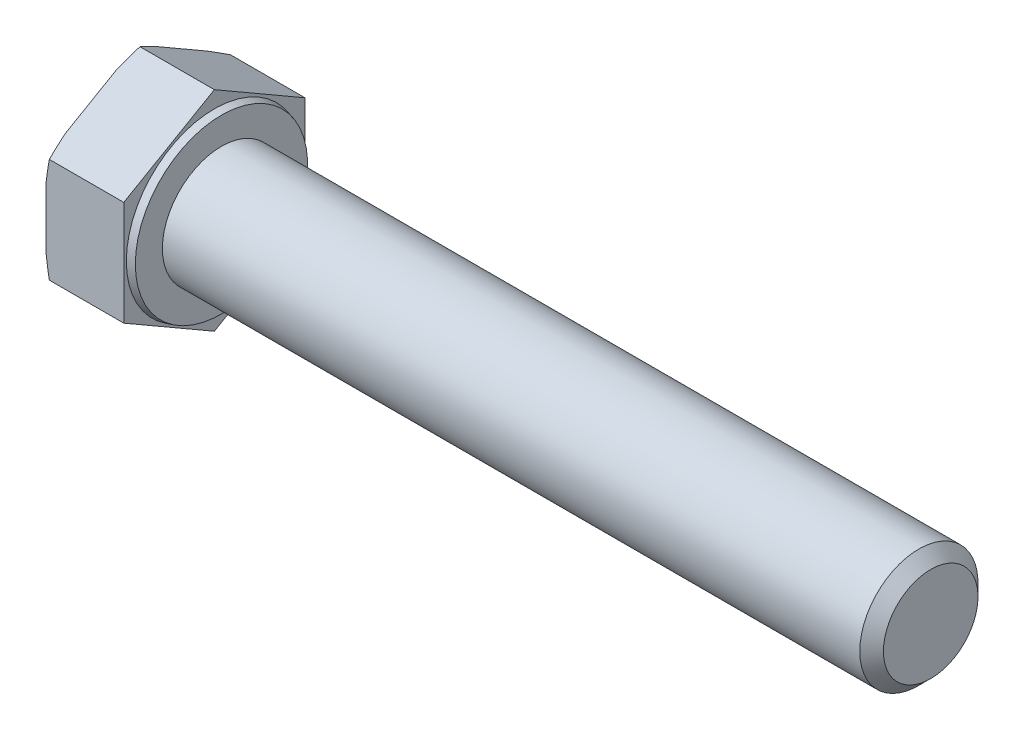
ISO-10303-21;
HEADER;
FILE_DESCRIPTION(('STEP AP214'),'2;1');
FILE_NAME('part.step','',(''),(''),'','','');
FILE_SCHEMA(('AUTOMOTIVE_DESIGN { 1 0 10303 214 1 1 1 1 }'));
ENDSEC;
DATA;
#1=APPLICATION_CONTEXT('core data for automotive mechanical design processes');
#2=APPLICATION_PROTOCOL_DEFINITION('international standard','automotive_design',2000,#1);
#3=PRODUCT_CONTEXT('',#1,'mechanical');
#4=PRODUCT('Part','Part','',(#3));
#5=PRODUCT_RELATED_PRODUCT_CATEGORY('part','',(#4));
#6=PRODUCT_DEFINITION_FORMATION('','',#4);
#7=PRODUCT_DEFINITION_CONTEXT('part definition',#1,'design');
#8=PRODUCT_DEFINITION('design','',#6,#7);
#9=PRODUCT_DEFINITION_SHAPE('','',#8);
#10=(LENGTH_UNIT() NAMED_UNIT(*) SI_UNIT(.MILLI.,.METRE.));
#11=(NAMED_UNIT(*) PLANE_ANGLE_UNIT() SI_UNIT($,.RADIAN.));
#12=(NAMED_UNIT(*) SI_UNIT($,.STERADIAN.) SOLID_ANGLE_UNIT());
#13=UNCERTAINTY_MEASURE_WITH_UNIT(LENGTH_MEASURE(1.E-05),#10,'distance_accuracy_value','');
#14=(GEOMETRIC_REPRESENTATION_CONTEXT(3) GLOBAL_UNCERTAINTY_ASSIGNED_CONTEXT((#13)) GLOBAL_UNIT_ASSIGNED_CONTEXT((#10,
#11,#12)) REPRESENTATION_CONTEXT('',''));
#15=CARTESIAN_POINT('',(0.,0.,0.));
#16=DIRECTION('',(0.,0.,1.));
#17=DIRECTION('',(1.,0.,0.));
#18=AXIS2_PLACEMENT_3D('',#15,#16,#17);
#19=CARTESIAN_POINT('',(60.6,-4.42500000000009,-7.66432482349223));
#20=DIRECTION('',(0.,-0.866025403784441,-0.499999999999995));
#21=DIRECTION('',(0.,0.499999999999995,-0.866025403784442));
#22=AXIS2_PLACEMENT_3D('',#19,#20,#21);
#23=PLANE('',#22);
#24=DIRECTION('',(-1.,0.,0.));
#25=VECTOR('',#24,1.);
#26=CARTESIAN_POINT('',(60.6,-8.85,0.));
#27=LINE('',#26,#25);
#28=CARTESIAN_POINT('',(0.,-8.85,0.));
#29=VERTEX_POINT('',#28);
#30=CARTESIAN_POINT('',(-6.29792306844368,-8.85,0.));
#31=VERTEX_POINT('',#30);
#32=EDGE_CURVE('E158',#29,#31,#27,.T.);
#33=ORIENTED_EDGE('',*,*,#32,.T.);
#34=CARTESIAN_POINT('',(-4.7699615006699,-11.9174022332107,5.3128965151713));
#35=CARTESIAN_POINT('',(-4.83614833570257,-11.8050473190038,5.11829209528478));
#36=CARTESIAN_POINT('',(-4.90167255003095,-11.6925948603644,4.92351872348535));
#37=CARTESIAN_POINT('',(-5.03118559698242,-11.4674663528304,4.53358471020429));
#38=CARTESIAN_POINT('',(-5.09517439305191,-11.3547902986816,4.33842405962226));
#39=CARTESIAN_POINT('',(-5.28456041407138,-11.0163157536771,3.75216895060564));
#40=CARTESIAN_POINT('',(-5.40733223857273,-10.7901468045144,3.3604328395613));
#41=CARTESIAN_POINT('',(-5.6448059473252,-10.3342684187143,2.57082831328319));
#42=CARTESIAN_POINT('',(-5.75941225873481,-10.1045464495324,2.17293819104533));
#43=CARTESIAN_POINT('',(-5.97591685440881,-9.6436033227612,1.3745612760779));
#44=CARTESIAN_POINT('',(-6.07781581130404,-9.41238224520545,0.974074621970506));
#45=CARTESIAN_POINT('',(-6.26134144326315,-8.95638364479249,0.184261877874952));
#46=CARTESIAN_POINT('',(-6.34355573274743,-8.73166601658845,-0.204960471530827));
#47=CARTESIAN_POINT('',(-6.48746045966097,-8.2805512783751,-0.986314118159489));
#48=CARTESIAN_POINT('',(-6.54915189984519,-8.05415425097467,-1.37844527229961));
#49=CARTESIAN_POINT('',(-6.62254434564547,-7.71410474496151,-1.96742829380309));
#50=CARTESIAN_POINT('',(-6.64378861584913,-7.60095958105454,-2.16340146632068));
#51=CARTESIAN_POINT('',(-6.67950592063896,-7.37440457175732,-2.55580625313272));
#52=CARTESIAN_POINT('',(-6.69397933196105,-7.26099474144627,-2.75223784130921));
#53=CARTESIAN_POINT('',(-6.71577657593379,-7.03401139991638,-3.14538452131075));
#54=CARTESIAN_POINT('',(-6.72310096885371,-6.92043790222292,-3.34209958970914));
#55=CARTESIAN_POINT('',(-6.73040192529392,-6.69323186195545,-3.73563199523893));
#56=CARTESIAN_POINT('',(-6.73037853713207,-6.57959931977464,-3.93244933168932));
#57=CARTESIAN_POINT('',(-6.72320871548941,-6.35929562962563,-4.31402651612232));
#58=CARTESIAN_POINT('',(-6.71649505277964,-6.25262090601261,-4.49879255730344));
#59=CARTESIAN_POINT('',(-6.69675463432834,-6.03941600442701,-4.86807427927242));
#60=CARTESIAN_POINT('',(-6.68372760236287,-5.93288583298344,-5.05258994875172));
#61=CARTESIAN_POINT('',(-6.63559663675346,-5.61363013252953,-5.60555704254388));
#62=CARTESIAN_POINT('',(-6.59144268713134,-5.40123548697151,-5.97343535990596));
#63=CARTESIAN_POINT('',(-6.48226269320506,-4.97681311893133,-6.70855646522027));
#64=CARTESIAN_POINT('',(-6.41713860156276,-4.7647919199632,-7.07578795411473));
#65=CARTESIAN_POINT('',(-6.27018625376656,-4.34222339340586,-7.80769811179158));
#66=CARTESIAN_POINT('',(-6.18835790112246,-4.1316760743376,-8.17237676581522));
#67=CARTESIAN_POINT('',(-6.00866271800198,-3.70472589760515,-8.91187616421634));
#68=CARTESIAN_POINT('',(-5.91033992742069,-3.48837165185492,-9.286612710289));
#69=CARTESIAN_POINT('',(-5.70311989656312,-3.05693413716248,-10.0338844060276));
#70=CARTESIAN_POINT('',(-5.59422212603359,-2.84185093252738,-10.4064194443103));
#71=CARTESIAN_POINT('',(-5.36943684134144,-2.41473283183158,-11.1462096955477));
#72=CARTESIAN_POINT('',(-5.25362330968472,-2.2026881429877,-11.5134818701005));
#73=CARTESIAN_POINT('',(-5.07537550670142,-1.88529185166037,-12.0632283728134));
#74=CARTESIAN_POINT('',(-5.01521325258259,-1.77961882394802,-12.2462594258008));
#75=CARTESIAN_POINT('',(-4.89354912869936,-1.56846779942573,-12.6119837283436));
#76=CARTESIAN_POINT('',(-4.83204728425027,-1.462989798971,-12.794676984212));
#77=CARTESIAN_POINT('',(-4.7699615006699,-1.35759776678936,-12.9772213386635));
#78=B_SPLINE_CURVE_WITH_KNOTS('',3,(#34,#35,#36,#37,#38,#39,#40,#41,#42,#43,#44,#45,#46,#47,#48,
#49,#50,#51,#52,#53,#54,#55,#56,#57,#58,#59,#60,#61,#62,#63,#64,#65,#66,#67,#68,#69,#70,#71,#72,
#73,#74,#75,#76,#77),.UNSPECIFIED.,.F.,.F.,(4,2,2,2,2,2,2,2,2,2,2,2,2,2,2,2,2,2,2,2,2,4),(0.,
0.70276173034238,1.40554017472233,2.81157217612387,4.23201032618944,5.6523732571052,
7.02270828812481,8.39297635416766,9.07474696516833,9.75647963740091,10.438158877887,
11.119833635759,11.7601005309412,12.4003954417532,13.6809617128842,14.9676044823533,
16.2542546841745,17.5852978857349,18.9164078632869,20.2352036230902,20.894426976119,
21.553637882061),.UNSPECIFIED.);
#79=CARTESIAN_POINT('',(-6.58000000000003,-7.90869530364146,-1.63038755949604));
#80=VERTEX_POINT('',#79);
#81=EDGE_CURVE('E203',#31,#80,#78,.T.);
#82=ORIENTED_EDGE('',*,*,#81,.T.);
#83=DIRECTION('',(0.,-0.499999999999995,0.866025403784442));
#84=VECTOR('',#83,1.);
#85=CARTESIAN_POINT('',(-6.58,-4.42500000000009,-7.66432482349223));
#86=LINE('',#85,#84);
#87=CARTESIAN_POINT('',(-6.58,-5.36630469635854,-6.03393726399618));
#88=VERTEX_POINT('',#87);
#89=EDGE_CURVE('E213',#88,#80,#86,.T.);
#90=ORIENTED_EDGE('',*,*,#89,.F.);
#91=CARTESIAN_POINT('',(-6.29792306844368,-4.42500000000009,-7.66432482349223));
#92=VERTEX_POINT('',#91);
#93=EDGE_CURVE('E216',#88,#92,#78,.T.);
#94=ORIENTED_EDGE('',*,*,#93,.T.);
#95=DIRECTION('',(-1.,0.,0.));
#96=VECTOR('',#95,1.);
#97=CARTESIAN_POINT('',(60.6,-4.42500000000009,-7.66432482349223));
#98=LINE('',#97,#96);
#99=CARTESIAN_POINT('',(0.,-4.42500000000009,-7.66432482349223));
#100=VERTEX_POINT('',#99);
#101=EDGE_CURVE('E169',#100,#92,#98,.T.);
#102=ORIENTED_EDGE('',*,*,#101,.F.);
#103=DIRECTION('',(0.,-0.499999999999995,0.866025403784442));
#104=VECTOR('',#103,1.);
#105=CARTESIAN_POINT('',(0.,-4.42500000000009,-7.66432482349223));
#106=LINE('',#105,#104);
#107=EDGE_CURVE('E184',#100,#29,#106,.T.);
#108=ORIENTED_EDGE('',*,*,#107,.T.);
#109=EDGE_LOOP('',(#33,#82,#90,#94,#102,#108));
#110=FACE_BOUND('',#109,.T.);
#111=ADVANCED_FACE('F36',(#110),#23,.T.);
#112=CARTESIAN_POINT('',(60.6,4.42499999999993,-7.66432482349232));
#113=DIRECTION('',(0.,0.,-1.));
#114=DIRECTION('',(0.,1.,0.));
#115=AXIS2_PLACEMENT_3D('',#112,#113,#114);
#116=PLANE('',#115);
#117=ORIENTED_EDGE('',*,*,#101,.T.);
#118=CARTESIAN_POINT('',(-5.00864005639831,-9.73789651517145,-7.66432482349217));
#119=CARTESIAN_POINT('',(-5.07003318744064,-9.52322769233334,-7.66432482349218));
#120=CARTESIAN_POINT('',(-5.13071664914256,-9.30835600664128,-7.66432482349218));
#121=CARTESIAN_POINT('',(-5.2504442425723,-8.87815277711283,-7.66432482349218));
#122=CARTESIAN_POINT('',(-5.30948834652955,-8.66282122555281,-7.66432482349219));
#123=CARTESIAN_POINT('',(-5.48387527888684,-8.01589307910885,-7.66432482349219));
#124=CARTESIAN_POINT('',(-5.59642298983084,-7.58353558067021,-7.6643248234922));
#125=CARTESIAN_POINT('',(-5.81266226723173,-6.71259000391773,-7.66432482349221));
#126=CARTESIAN_POINT('',(-5.91626806915323,-6.27398046842187,-7.66432482349221));
#127=CARTESIAN_POINT('',(-6.11029091280608,-5.39384656433909,-7.66432482349222));
#128=CARTESIAN_POINT('',(-6.20070892550878,-4.95232241284974,-7.66432482349222));
#129=CARTESIAN_POINT('',(-6.36160933963008,-4.08051166755351,-7.66432482349223));
#130=CARTESIAN_POINT('',(-6.43264625776086,-3.65032885049375,-7.66432482349224));
#131=CARTESIAN_POINT('',(-6.55428187483288,-2.78707107422335,-7.66432482349225));
#132=CARTESIAN_POINT('',(-6.60488453148917,-2.35399669158535,-7.66432482349225));
#133=CARTESIAN_POINT('',(-6.66240831794471,-1.70368188145931,-7.66432482349226));
#134=CARTESIAN_POINT('',(-6.67850532779577,-1.48723464984804,-7.66432482349226));
#135=CARTESIAN_POINT('',(-6.70429433272965,-1.05396299728827,-7.66432482349227));
#136=CARTESIAN_POINT('',(-6.71398664875919,-0.837138595786226,-7.66432482349227));
#137=CARTESIAN_POINT('',(-6.72672253024382,-0.403302294793051,-7.66432482349227));
#138=CARTESIAN_POINT('',(-6.72976638437883,-0.186290403852155,-7.66432482349227));
#139=CARTESIAN_POINT('',(-6.7291358967764,0.247718950123678,-7.66432482349228));
#140=CARTESIAN_POINT('',(-6.72546155695146,0.464716413162706,-7.66432482349228));
#141=CARTESIAN_POINT('',(-6.70624362970486,1.06036953223341,-7.66432482349229));
#142=CARTESIAN_POINT('',(-6.68388895075078,1.43882252598365,-7.66432482349229));
#143=CARTESIAN_POINT('',(-6.62050559151052,2.19412494594648,-7.6643248234923));
#144=CARTESIAN_POINT('',(-6.57947609181733,2.57097430106276,-7.6643248234923));
#145=CARTESIAN_POINT('',(-6.48113797206862,3.32388976987407,-7.66432482349231));
#146=CARTESIAN_POINT('',(-6.4237712185853,3.69994816672772,-7.66432482349232));
#147=CARTESIAN_POINT('',(-6.2956564145037,4.44978573942378,-7.66432482349232));
#148=CARTESIAN_POINT('',(-6.22490691200718,4.82356466341955,-7.66432482349233));
#149=CARTESIAN_POINT('',(-6.0704014797458,5.58003633732887,-7.66432482349234));
#150=CARTESIAN_POINT('',(-5.98632024183774,5.96266195818458,-7.66432482349234));
#151=CARTESIAN_POINT('',(-5.80919867667365,6.72583533235177,-7.66432482349235));
#152=CARTESIAN_POINT('',(-5.71615790531566,7.10638298167437,-7.66432482349235));
#153=CARTESIAN_POINT('',(-5.52374117974904,7.86297645537245,-7.66432482349236));
#154=CARTESIAN_POINT('',(-5.42441511026811,8.23903503370974,-7.66432482349236));
#155=CARTESIAN_POINT('',(-5.27134102225385,8.80195695976291,-7.66432482349237));
#156=CARTESIAN_POINT('',(-5.21964171692946,8.98938164843282,-7.66432482349237));
#157=CARTESIAN_POINT('',(-5.11502150400523,9.36388780999383,-7.66432482349237));
#158=CARTESIAN_POINT('',(-5.06210060924165,9.55096928646908,-7.66432482349238));
#159=CARTESIAN_POINT('',(-5.00864005639831,9.73789651517129,-7.66432482349238));
#160=B_SPLINE_CURVE_WITH_KNOTS('',3,(#118,#119,#120,#121,#122,#123,#124,#125,#126,#127,#128,
#129,#130,#131,#132,#133,#134,#135,#136,#137,#138,#139,#140,#141,#142,#143,#144,#145,#146,#147,
#148,#149,#150,#151,#152,#153,#154,#155,#156,#157,#158,#159),.UNSPECIFIED.,.F.,.F.,(4,2,2,2,2,2,
2,2,2,2,2,2,2,2,2,2,2,2,2,2,4),(0.,0.669823290546161,1.33965792092904,2.67986595636369,
4.03175825312792,5.38355096443301,6.69120700403605,7.99860965473741,8.64966414612008,
9.300686009923,9.95167960543101,10.6026730156168,11.7394565125237,12.876289893615,
14.0172201663474,15.1582742899967,16.3334026116279,17.5085892114817,18.6753990362947,
19.2586689197893,19.8419326771629),.UNSPECIFIED.);
#161=CARTESIAN_POINT('',(-6.58000000000003,-2.54239060728318,-7.66432482349217));
#162=VERTEX_POINT('',#161);
#163=EDGE_CURVE('E224',#92,#162,#160,.T.);
#164=ORIENTED_EDGE('',*,*,#163,.T.);
#165=DIRECTION('',(0.,-1.,0.));
#166=VECTOR('',#165,1.);
#167=CARTESIAN_POINT('',(-6.58,4.42499999999993,-7.66432482349232));
#168=LINE('',#167,#166);
#169=CARTESIAN_POINT('',(-6.58,2.54239060728305,-7.6643248234923));
#170=VERTEX_POINT('',#169);
#171=EDGE_CURVE('E164',#170,#162,#168,.T.);
#172=ORIENTED_EDGE('',*,*,#171,.F.);
#173=CARTESIAN_POINT('',(-6.29792306844368,4.42499999999993,-7.66432482349232));
#174=VERTEX_POINT('',#173);
#175=EDGE_CURVE('E51',#170,#174,#160,.T.);
#176=ORIENTED_EDGE('',*,*,#175,.T.);
#177=DIRECTION('',(-1.,0.,0.));
#178=VECTOR('',#177,1.);
#179=CARTESIAN_POINT('',(60.6,4.42499999999993,-7.66432482349232));
#180=LINE('',#179,#178);
#181=CARTESIAN_POINT('',(0.,4.42499999999993,-7.66432482349232));
#182=VERTEX_POINT('',#181);
#183=EDGE_CURVE('E155',#182,#174,#180,.T.);
#184=ORIENTED_EDGE('',*,*,#183,.F.);
#185=DIRECTION('',(0.,-1.,0.));
#186=VECTOR('',#185,1.);
#187=CARTESIAN_POINT('',(0.,8.84999999999992,-7.66432482349237));
#188=LINE('',#187,#186);
#189=EDGE_CURVE('E182',#182,#100,#188,.T.);
#190=ORIENTED_EDGE('',*,*,#189,.T.);
#191=EDGE_LOOP('',(#117,#164,#172,#176,#184,#190));
#192=FACE_BOUND('',#191,.T.);
#193=ADVANCED_FACE('F251',(#192),#116,.T.);
#194=CARTESIAN_POINT('',(60.6,8.85,0.));
#195=DIRECTION('',(0.,0.866025403784434,-0.500000000000007));
#196=DIRECTION('',(0.,0.500000000000007,0.866025403784435));
#197=AXIS2_PLACEMENT_3D('',#194,#195,#196);
#198=PLANE('',#197);
#199=ORIENTED_EDGE('',*,*,#183,.T.);
#200=CARTESIAN_POINT('',(-4.76996150066986,1.35759776678906,-12.9772213386637));
#201=CARTESIAN_POINT('',(-4.83614833570253,1.46995268099604,-12.7826169187772));
#202=CARTESIAN_POINT('',(-4.9016725500309,1.58240513963541,-12.5878435469777));
#203=CARTESIAN_POINT('',(-5.03118559698238,1.80753364716942,-12.1979095336967));
#204=CARTESIAN_POINT('',(-5.09517439305187,1.92020970131819,-12.0027488831146));
#205=CARTESIAN_POINT('',(-5.28456041407135,2.25868424632273,-11.416493774098));
#206=CARTESIAN_POINT('',(-5.40733223857269,2.48485319548548,-11.0247576630537));
#207=CARTESIAN_POINT('',(-5.64480594732518,2.94073158128551,-10.2351531367756));
#208=CARTESIAN_POINT('',(-5.75941225873478,3.17045355046743,-9.83726301453771));
#209=CARTESIAN_POINT('',(-5.97591685440879,3.63139667723867,-9.03888609957028));
#210=CARTESIAN_POINT('',(-6.07781581130402,3.86261775479443,-8.63839944546289));
#211=CARTESIAN_POINT('',(-6.26134144326313,4.3186163552074,-7.84858670136733));
#212=CARTESIAN_POINT('',(-6.34355573274742,4.54333398341145,-7.45936435196155));
#213=CARTESIAN_POINT('',(-6.48746045966097,4.99444872162482,-6.67801070533289));
#214=CARTESIAN_POINT('',(-6.54915189984519,5.22084574902526,-6.28587955119277));
#215=CARTESIAN_POINT('',(-6.62254434564547,5.56089525503842,-5.69689652968929));
#216=CARTESIAN_POINT('',(-6.64378861584913,5.6740404189454,-5.5009233571717));
#217=CARTESIAN_POINT('',(-6.67950592063896,5.90059542824263,-5.10851857035966));
#218=CARTESIAN_POINT('',(-6.69397933196106,6.01400525855368,-4.91208698218317));
#219=CARTESIAN_POINT('',(-6.7157765759338,6.24098860008357,-4.51894030218163));
#220=CARTESIAN_POINT('',(-6.72310096885372,6.35456209777704,-4.32222523378324));
#221=CARTESIAN_POINT('',(-6.73040192529394,6.58176813804451,-3.92869282825345));
#222=CARTESIAN_POINT('',(-6.73037853713208,6.69540068022533,-3.73187549180306));
#223=CARTESIAN_POINT('',(-6.72320871548943,6.91570437037435,-3.35029830737006));
#224=CARTESIAN_POINT('',(-6.71649505277966,7.02237909398737,-3.16553226618894));
#225=CARTESIAN_POINT('',(-6.69675463432836,7.23558399557298,-2.79625054421994));
#226=CARTESIAN_POINT('',(-6.68372760236289,7.34211416701656,-2.61173487474064));
#227=CARTESIAN_POINT('',(-6.63559663675348,7.66136986747048,-2.05876778094847));
#228=CARTESIAN_POINT('',(-6.59144268713136,7.87376451302852,-1.69088946358639));
#229=CARTESIAN_POINT('',(-6.48226269320508,8.29818688106872,-0.955768358272067));
#230=CARTESIAN_POINT('',(-6.41713860156277,8.51020808003686,-0.588536869377594));
#231=CARTESIAN_POINT('',(-6.27018625376657,8.93277660659422,0.143373288299262));
#232=CARTESIAN_POINT('',(-6.18835790112246,9.14332392566248,0.508051942322907));
#233=CARTESIAN_POINT('',(-6.00866271800198,9.57027410239495,1.24755134072404));
#234=CARTESIAN_POINT('',(-5.91033992742068,9.7866283481452,1.62228788679671));
#235=CARTESIAN_POINT('',(-5.7031198965631,10.2180658628377,2.36955958253528));
#236=CARTESIAN_POINT('',(-5.59422212603357,10.4331490674728,2.74209462081801));
#237=CARTESIAN_POINT('',(-5.36943684134141,10.8602671681686,3.48188487205548));
#238=CARTESIAN_POINT('',(-5.25362330968469,11.0723118570125,3.84915704660823));
#239=CARTESIAN_POINT('',(-5.07537550670138,11.3897081483398,4.39890354932111));
#240=CARTESIAN_POINT('',(-5.01521325258256,11.4953811760522,4.58193460230855));
#241=CARTESIAN_POINT('',(-4.89354912869931,11.7065322005745,4.94765890485139));
#242=CARTESIAN_POINT('',(-4.83204728425022,11.8120102010292,5.13035216071975));
#243=CARTESIAN_POINT('',(-4.76996150066986,11.9174022332109,5.3128965151713));
#244=B_SPLINE_CURVE_WITH_KNOTS('',3,(#200,#201,#202,#203,#204,#205,#206,#207,#208,#209,#210,
#211,#212,#213,#214,#215,#216,#217,#218,#219,#220,#221,#222,#223,#224,#225,#226,#227,#228,#229,
#230,#231,#232,#233,#234,#235,#236,#237,#238,#239,#240,#241,#242,#243),.UNSPECIFIED.,.F.,.F.,(4,
2,2,2,2,2,2,2,2,2,2,2,2,2,2,2,2,2,2,2,2,4),(0.,0.702761730342387,1.40554017472235,
2.8115721761239,4.23201032618948,5.65237325710526,7.02270828812488,8.39297635416775,
9.07474696516843,9.75647963740101,10.4381588778871,11.1198336357591,11.7601005309413,
12.4003954417533,13.6809617128843,14.9676044823535,16.2542546841748,17.5852978857351,
18.9164078632872,20.2352036230905,20.8944269761194,21.5536378820614),.UNSPECIFIED.);
#245=CARTESIAN_POINT('',(-6.58000000000003,5.36630469635833,-6.03393726399625));
#246=VERTEX_POINT('',#245);
#247=EDGE_CURVE('E246',#174,#246,#244,.T.);
#248=ORIENTED_EDGE('',*,*,#247,.T.);
#249=DIRECTION('',(0.,-0.500000000000007,-0.866025403784435));
#250=VECTOR('',#249,1.);
#251=CARTESIAN_POINT('',(-6.58,8.85,0.));
#252=LINE('',#251,#250);
#253=CARTESIAN_POINT('',(-6.58,7.90869530364155,-1.63038755949607));
#254=VERTEX_POINT('',#253);
#255=EDGE_CURVE('E236',#254,#246,#252,.T.);
#256=ORIENTED_EDGE('',*,*,#255,.F.);
#257=CARTESIAN_POINT('',(-6.29792306844368,8.85,0.));
#258=VERTEX_POINT('',#257);
#259=EDGE_CURVE('E59',#254,#258,#244,.T.);
#260=ORIENTED_EDGE('',*,*,#259,.T.);
#261=DIRECTION('',(-1.,0.,0.));
#262=VECTOR('',#261,1.);
#263=CARTESIAN_POINT('',(60.6,8.85,0.));
#264=LINE('',#263,#262);
#265=CARTESIAN_POINT('',(0.,8.85,0.));
#266=VERTEX_POINT('',#265);
#267=EDGE_CURVE('E152',#266,#258,#264,.T.);
#268=ORIENTED_EDGE('',*,*,#267,.F.);
#269=DIRECTION('',(0.,-0.500000000000007,-0.866025403784435));
#270=VECTOR('',#269,1.);
#271=CARTESIAN_POINT('',(0.,8.85000000000003,0.));
#272=LINE('',#271,#270);
#273=EDGE_CURVE('E180',#266,#182,#272,.T.);
#274=ORIENTED_EDGE('',*,*,#273,.T.);
#275=EDGE_LOOP('',(#199,#248,#256,#260,#268,#274));
#276=FACE_BOUND('',#275,.T.);
#277=ADVANCED_FACE('F244',(#276),#198,.T.);
#278=CARTESIAN_POINT('',(60.6,4.42500000000004,7.66432482349226));
#279=DIRECTION('',(0.,0.866025403784441,0.499999999999995));
#280=DIRECTION('',(0.,-0.499999999999995,0.866025403784442));
#281=AXIS2_PLACEMENT_3D('',#278,#279,#280);
#282=PLANE('',#281);
#283=ORIENTED_EDGE('',*,*,#267,.T.);
#284=CARTESIAN_POINT('',(-4.76996150066987,11.9174022332108,-5.31289651517142));
#285=CARTESIAN_POINT('',(-4.83614833570254,11.8050473190038,-5.1182920952849));
#286=CARTESIAN_POINT('',(-4.90167255003092,11.6925948603644,-4.92351872348547));
#287=CARTESIAN_POINT('',(-5.03118559698239,11.4674663528304,-4.53358471020441));
#288=CARTESIAN_POINT('',(-5.09517439305188,11.3547902986817,-4.33842405962238));
#289=CARTESIAN_POINT('',(-5.28456041407136,11.0163157536771,-3.75216895060575));
#290=CARTESIAN_POINT('',(-5.40733223857271,10.7901468045144,-3.36043283956141));
#291=CARTESIAN_POINT('',(-5.64480594732519,10.3342684187144,-2.5708283132833));
#292=CARTESIAN_POINT('',(-5.75941225873479,10.1045464495324,-2.17293819104543));
#293=CARTESIAN_POINT('',(-5.9759168544088,9.64360332276122,-1.374561276078));
#294=CARTESIAN_POINT('',(-6.07781581130403,9.41238224520547,-0.974074621970603));
#295=CARTESIAN_POINT('',(-6.26134144326314,8.95638364479251,-0.184261877875045));
#296=CARTESIAN_POINT('',(-6.34355573274742,8.73166601658846,0.204960471530737));
#297=CARTESIAN_POINT('',(-6.48746045966097,8.28055127837511,0.986314118159404));
#298=CARTESIAN_POINT('',(-6.54915189984519,8.05415425097468,1.37844527229953));
#299=CARTESIAN_POINT('',(-6.62254434564547,7.71410474496152,1.96742829380302));
#300=CARTESIAN_POINT('',(-6.64378861584914,7.60095958105455,2.1634014663206));
#301=CARTESIAN_POINT('',(-6.67950592063896,7.37440457175732,2.55580625313264));
#302=CARTESIAN_POINT('',(-6.69397933196106,7.26099474144628,2.75223784130914));
#303=CARTESIAN_POINT('',(-6.7157765759338,7.03401139991639,3.14538452131068));
#304=CARTESIAN_POINT('',(-6.72310096885372,6.92043790222292,3.34209958970907));
#305=CARTESIAN_POINT('',(-6.73040192529394,6.69323186195546,3.73563199523886));
#306=CARTESIAN_POINT('',(-6.73037853713208,6.57959931977464,3.93244933168925));
#307=CARTESIAN_POINT('',(-6.72320871548943,6.35929562962563,4.31402651612225));
#308=CARTESIAN_POINT('',(-6.71649505277966,6.25262090601261,4.49879255730338));
#309=CARTESIAN_POINT('',(-6.69675463432836,6.03941600442701,4.86807427927237));
#310=CARTESIAN_POINT('',(-6.68372760236289,5.93288583298343,5.05258994875167));
#311=CARTESIAN_POINT('',(-6.63559663675348,5.61363013252952,5.60555704254384));
#312=CARTESIAN_POINT('',(-6.59144268713136,5.40123548697149,5.97343535990593));
#313=CARTESIAN_POINT('',(-6.48226269320508,4.9768131189313,6.70855646522025));
#314=CARTESIAN_POINT('',(-6.41713860156277,4.76479191996317,7.07578795411472));
#315=CARTESIAN_POINT('',(-6.27018625376657,4.34222339340582,7.80769811179158));
#316=CARTESIAN_POINT('',(-6.18835790112247,4.13167607433756,8.17237676581522));
#317=CARTESIAN_POINT('',(-6.00866271800198,3.70472589760511,8.91187616421636));
#318=CARTESIAN_POINT('',(-5.91033992742069,3.48837165185487,9.28661271028903));
#319=CARTESIAN_POINT('',(-5.70311989656311,3.05693413716242,10.0338844060276));
#320=CARTESIAN_POINT('',(-5.59422212603358,2.84185093252732,10.4064194443103));
#321=CARTESIAN_POINT('',(-5.36943684134142,2.41473283183151,11.1462096955478));
#322=CARTESIAN_POINT('',(-5.2536233096847,2.20268814298763,11.5134818701005));
#323=CARTESIAN_POINT('',(-5.07537550670139,1.88529185166029,12.0632283728134));
#324=CARTESIAN_POINT('',(-5.01521325258257,1.77961882394793,12.2462594258009));
#325=CARTESIAN_POINT('',(-4.89354912869933,1.56846779942564,12.6119837283437));
#326=CARTESIAN_POINT('',(-4.83204728425023,1.46298979897091,12.7946769842121));
#327=CARTESIAN_POINT('',(-4.76996150066987,1.35759776678926,12.9772213386636));
#328=B_SPLINE_CURVE_WITH_KNOTS('',3,(#284,#285,#286,#287,#288,#289,#290,#291,#292,#293,#294,
#295,#296,#297,#298,#299,#300,#301,#302,#303,#304,#305,#306,#307,#308,#309,#310,#311,#312,#313,
#314,#315,#316,#317,#318,#319,#320,#321,#322,#323,#324,#325,#326,#327),.UNSPECIFIED.,.F.,.F.,(4,
2,2,2,2,2,2,2,2,2,2,2,2,2,2,2,2,2,2,2,2,4),(0.,0.702761730342384,1.40554017472234,
2.81157217612389,4.23201032618947,5.65237325710524,7.02270828812486,8.39297635416772,
9.0747469651684,9.75647963740098,10.4381588778871,11.119833635759,11.7601005309412,
12.4003954417533,13.6809617128843,14.9676044823535,16.2542546841747,17.585297885735,
18.9164078632871,20.2352036230904,20.8944269761193,21.5536378820612),.UNSPECIFIED.);
#329=CARTESIAN_POINT('',(-6.58000000000003,7.90869530364148,1.63038755949594));
#330=VERTEX_POINT('',#329);
#331=EDGE_CURVE('E146',#258,#330,#328,.T.);
#332=ORIENTED_EDGE('',*,*,#331,.T.);
#333=DIRECTION('',(0.,0.499999999999995,-0.866025403784442));
#334=VECTOR('',#333,1.);
#335=CARTESIAN_POINT('',(-6.58,4.42500000000004,7.66432482349226));
#336=LINE('',#335,#334);
#337=CARTESIAN_POINT('',(-6.58,5.36630469635847,6.03393726399624));
#338=VERTEX_POINT('',#337);
#339=EDGE_CURVE('E145',#338,#330,#336,.T.);
#340=ORIENTED_EDGE('',*,*,#339,.F.);
#341=CARTESIAN_POINT('',(-6.29792306844368,4.42500000000004,7.66432482349226));
#342=VERTEX_POINT('',#341);
#343=EDGE_CURVE('E127',#338,#342,#328,.T.);
#344=ORIENTED_EDGE('',*,*,#343,.T.);
#345=DIRECTION('',(-1.,0.,0.));
#346=VECTOR('',#345,1.);
#347=CARTESIAN_POINT('',(60.6,4.42500000000004,7.66432482349226));
#348=LINE('',#347,#346);
#349=CARTESIAN_POINT('',(0.,4.42500000000004,7.66432482349226));
#350=VERTEX_POINT('',#349);
#351=EDGE_CURVE('E141',#350,#342,#348,.T.);
#352=ORIENTED_EDGE('',*,*,#351,.F.);
#353=DIRECTION('',(0.,0.499999999999995,-0.866025403784442));
#354=VECTOR('',#353,1.);
#355=CARTESIAN_POINT('',(0.,8.84999999999997,0.));
#356=LINE('',#355,#354);
#357=EDGE_CURVE('E178',#350,#266,#356,.T.);
#358=ORIENTED_EDGE('',*,*,#357,.T.);
#359=EDGE_LOOP('',(#283,#332,#340,#344,#352,#358));
#360=FACE_BOUND('',#359,.T.);
#361=ADVANCED_FACE('F140',(#360),#282,.T.);
#362=CARTESIAN_POINT('',(60.6,-4.42499999999998,7.66432482349229));
#363=DIRECTION('',(0.,0.,1.));
#364=DIRECTION('',(0.,-1.,0.));
#365=AXIS2_PLACEMENT_3D('',#362,#363,#364);
#366=PLANE('',#365);
#367=ORIENTED_EDGE('',*,*,#351,.T.);
#368=CARTESIAN_POINT('',(-5.00864005639831,9.7378965151714,7.66432482349224));
#369=CARTESIAN_POINT('',(-5.07003318744064,9.52322769233328,7.66432482349224));
#370=CARTESIAN_POINT('',(-5.13071664914256,9.30835600664122,7.66432482349224));
#371=CARTESIAN_POINT('',(-5.2504442425723,8.87815277711278,7.66432482349225));
#372=CARTESIAN_POINT('',(-5.30948834652955,8.66282122555276,7.66432482349225));
#373=CARTESIAN_POINT('',(-5.48387527888684,8.0158930791088,7.66432482349225));
#374=CARTESIAN_POINT('',(-5.59642298983084,7.58353558067016,7.66432482349225));
#375=CARTESIAN_POINT('',(-5.81266226723173,6.71259000391768,7.66432482349225));
#376=CARTESIAN_POINT('',(-5.91626806915323,6.27398046842182,7.66432482349225));
#377=CARTESIAN_POINT('',(-6.11029091280608,5.39384656433903,7.66432482349226));
#378=CARTESIAN_POINT('',(-6.20070892550878,4.95232241284969,7.66432482349226));
#379=CARTESIAN_POINT('',(-6.36160933963008,4.08051166755345,7.66432482349226));
#380=CARTESIAN_POINT('',(-6.43264625776087,3.6503288504937,7.66432482349226));
#381=CARTESIAN_POINT('',(-6.55428187483288,2.7870710742233,7.66432482349227));
#382=CARTESIAN_POINT('',(-6.60488453148917,2.3539966915853,7.66432482349227));
#383=CARTESIAN_POINT('',(-6.66240831794471,1.70368188145926,7.66432482349227));
#384=CARTESIAN_POINT('',(-6.67850532779577,1.48723464984798,7.66432482349227));
#385=CARTESIAN_POINT('',(-6.70429433272965,1.05396299728821,7.66432482349227));
#386=CARTESIAN_POINT('',(-6.71398664875919,0.83713859578617,7.66432482349227));
#387=CARTESIAN_POINT('',(-6.72672253024382,0.403302294792995,7.66432482349227));
#388=CARTESIAN_POINT('',(-6.72976638437883,0.1862904038521,7.66432482349228));
#389=CARTESIAN_POINT('',(-6.7291358967764,-0.247718950123733,7.66432482349228));
#390=CARTESIAN_POINT('',(-6.72546155695146,-0.46471641316276,7.66432482349228));
#391=CARTESIAN_POINT('',(-6.70624362970486,-1.06036953223346,7.66432482349228));
#392=CARTESIAN_POINT('',(-6.68388895075078,-1.43882252598371,7.66432482349228));
#393=CARTESIAN_POINT('',(-6.62050559151052,-2.19412494594653,7.66432482349228));
#394=CARTESIAN_POINT('',(-6.57947609181733,-2.57097430106281,7.66432482349229));
#395=CARTESIAN_POINT('',(-6.48113797206862,-3.32388976987413,7.66432482349229));
#396=CARTESIAN_POINT('',(-6.4237712185853,-3.69994816672777,7.66432482349229));
#397=CARTESIAN_POINT('',(-6.2956564145037,-4.44978573942384,7.66432482349229));
#398=CARTESIAN_POINT('',(-6.22490691200718,-4.8235646634196,7.66432482349229));
#399=CARTESIAN_POINT('',(-6.0704014797458,-5.58003633732892,7.6643248234923));
#400=CARTESIAN_POINT('',(-5.98632024183774,-5.96266195818463,7.6643248234923));
#401=CARTESIAN_POINT('',(-5.80919867667365,-6.72583533235183,7.6643248234923));
#402=CARTESIAN_POINT('',(-5.71615790531566,-7.10638298167442,7.6643248234923));
#403=CARTESIAN_POINT('',(-5.52374117974904,-7.8629764553725,7.66432482349231));
#404=CARTESIAN_POINT('',(-5.42441511026811,-8.2390350337098,7.66432482349231));
#405=CARTESIAN_POINT('',(-5.27134102225385,-8.80195695976297,7.66432482349231));
#406=CARTESIAN_POINT('',(-5.21964171692946,-8.98938164843288,7.66432482349231));
#407=CARTESIAN_POINT('',(-5.11502150400523,-9.36388780999389,7.66432482349231));
#408=CARTESIAN_POINT('',(-5.06210060924165,-9.55096928646914,7.66432482349231));
#409=CARTESIAN_POINT('',(-5.00864005639831,-9.73789651517135,7.66432482349231));
#410=B_SPLINE_CURVE_WITH_KNOTS('',3,(#368,#369,#370,#371,#372,#373,#374,#375,#376,#377,#378,
#379,#380,#381,#382,#383,#384,#385,#386,#387,#388,#389,#390,#391,#392,#393,#394,#395,#396,#397,
#398,#399,#400,#401,#402,#403,#404,#405,#406,#407,#408,#409),.UNSPECIFIED.,.F.,.F.,(4,2,2,2,2,2,
2,2,2,2,2,2,2,2,2,2,2,2,2,2,4),(0.,0.669823290546161,1.33965792092904,2.67986595636369,
4.03175825312792,5.38355096443301,6.69120700403605,7.99860965473742,8.64966414612009,
9.300686009923,9.95167960543102,10.6026730156168,11.7394565125237,12.876289893615,
14.0172201663474,15.1582742899967,16.3334026116279,17.5085892114817,18.6753990362947,
19.2586689197893,19.8419326771629),.UNSPECIFIED.);
#411=CARTESIAN_POINT('',(-6.58000000000003,2.54239060728313,7.66432482349219));
#412=VERTEX_POINT('',#411);
#413=EDGE_CURVE('E124',#342,#412,#410,.T.);
#414=ORIENTED_EDGE('',*,*,#413,.T.);
#415=DIRECTION('',(0.,1.,0.));
#416=VECTOR('',#415,1.);
#417=CARTESIAN_POINT('',(-6.58,-4.42499999999998,7.66432482349229));
#418=LINE('',#417,#416);
#419=CARTESIAN_POINT('',(-6.58,-2.5423906072831,7.66432482349229));
#420=VERTEX_POINT('',#419);
#421=EDGE_CURVE('E222',#420,#412,#418,.T.);
#422=ORIENTED_EDGE('',*,*,#421,.F.);
#423=CARTESIAN_POINT('',(-6.29792306844368,-4.42499999999998,7.66432482349229));
#424=VERTEX_POINT('',#423);
#425=EDGE_CURVE('E134',#420,#424,#410,.T.);
#426=ORIENTED_EDGE('',*,*,#425,.T.);
#427=DIRECTION('',(-1.,0.,0.));
#428=VECTOR('',#427,1.);
#429=CARTESIAN_POINT('',(60.6,-4.42499999999998,7.66432482349229));
#430=LINE('',#429,#428);
#431=CARTESIAN_POINT('',(0.,-4.42499999999998,7.66432482349229));
#432=VERTEX_POINT('',#431);
#433=EDGE_CURVE('E153',#432,#424,#430,.T.);
#434=ORIENTED_EDGE('',*,*,#433,.F.);
#435=DIRECTION('',(0.,1.,0.));
#436=VECTOR('',#435,1.);
#437=CARTESIAN_POINT('',(0.,8.85000000000003,7.66432482349225));
#438=LINE('',#437,#436);
#439=EDGE_CURVE('E151',#432,#350,#438,.T.);
#440=ORIENTED_EDGE('',*,*,#439,.T.);
#441=EDGE_LOOP('',(#367,#414,#422,#426,#434,#440));
#442=FACE_BOUND('',#441,.T.);
#443=ADVANCED_FACE('F148',(#442),#366,.T.);
#444=CARTESIAN_POINT('',(60.6,-8.85,0.));
#445=DIRECTION('',(0.,-0.866025403784438,0.500000000000001));
#446=DIRECTION('',(0.,-0.500000000000001,-0.866025403784438));
#447=AXIS2_PLACEMENT_3D('',#444,#445,#446);
#448=PLANE('',#447);
#449=ORIENTED_EDGE('',*,*,#433,.T.);
#450=CARTESIAN_POINT('',(-4.76996150066987,-1.35759776678916,12.9772213386637));
#451=CARTESIAN_POINT('',(-4.83614833570253,-1.46995268099614,12.7826169187771));
#452=CARTESIAN_POINT('',(-4.90167255003091,-1.58240513963551,12.5878435469777));
#453=CARTESIAN_POINT('',(-5.03118559698238,-1.80753364716952,12.1979095336966));
#454=CARTESIAN_POINT('',(-5.09517439305187,-1.92020970131828,12.0027488831146));
#455=CARTESIAN_POINT('',(-5.28456041407135,-2.25868424632282,11.416493774098));
#456=CARTESIAN_POINT('',(-5.4073322385727,-2.48485319548557,11.0247576630537));
#457=CARTESIAN_POINT('',(-5.64480594732518,-2.94073158128559,10.2351531367755));
#458=CARTESIAN_POINT('',(-5.75941225873479,-3.17045355046751,9.83726301453767));
#459=CARTESIAN_POINT('',(-5.97591685440879,-3.63139667723874,9.03888609957024));
#460=CARTESIAN_POINT('',(-6.07781581130402,-3.8626177547945,8.63839944546285));
#461=CARTESIAN_POINT('',(-6.26134144326314,-4.31861635520747,7.84858670136729));
#462=CARTESIAN_POINT('',(-6.34355573274742,-4.54333398341151,7.45936435196151));
#463=CARTESIAN_POINT('',(-6.48746045966097,-4.99444872162487,6.67801070533284));
#464=CARTESIAN_POINT('',(-6.54915189984519,-5.22084574902531,6.28587955119272));
#465=CARTESIAN_POINT('',(-6.62254434564547,-5.56089525503847,5.69689652968923));
#466=CARTESIAN_POINT('',(-6.64378861584913,-5.67404041894544,5.50092335717165));
#467=CARTESIAN_POINT('',(-6.67950592063896,-5.90059542824267,5.10851857035961));
#468=CARTESIAN_POINT('',(-6.69397933196106,-6.01400525855372,4.91208698218311));
#469=CARTESIAN_POINT('',(-6.7157765759338,-6.24098860008361,4.51894030218158));
#470=CARTESIAN_POINT('',(-6.72310096885372,-6.35456209777708,4.32222523378318));
#471=CARTESIAN_POINT('',(-6.73040192529394,-6.58176813804455,3.92869282825339));
#472=CARTESIAN_POINT('',(-6.73037853713208,-6.69540068022536,3.731875491803));
#473=CARTESIAN_POINT('',(-6.72320871548943,-6.91570437037438,3.35029830737));
#474=CARTESIAN_POINT('',(-6.71649505277966,-7.0223790939874,3.16553226618888));
#475=CARTESIAN_POINT('',(-6.69675463432836,-7.23558399557301,2.79625054421989));
#476=CARTESIAN_POINT('',(-6.68372760236289,-7.34211416701659,2.61173487474059));
#477=CARTESIAN_POINT('',(-6.63559663675348,-7.6613698674705,2.05876778094842));
#478=CARTESIAN_POINT('',(-6.59144268713136,-7.87376451302853,1.69088946358633));
#479=CARTESIAN_POINT('',(-6.48226269320508,-8.29818688106873,0.955768358272008));
#480=CARTESIAN_POINT('',(-6.41713860156277,-8.51020808003686,0.588536869377535));
#481=CARTESIAN_POINT('',(-6.27018625376657,-8.93277660659422,-0.143373288299321));
#482=CARTESIAN_POINT('',(-6.18835790112247,-9.14332392566248,-0.508051942322965));
#483=CARTESIAN_POINT('',(-6.00866271800198,-9.57027410239494,-1.2475513407241));
#484=CARTESIAN_POINT('',(-5.91033992742068,-9.78662834814518,-1.62228788679677));
#485=CARTESIAN_POINT('',(-5.7031198965631,-10.2180658628376,-2.36955958253534));
#486=CARTESIAN_POINT('',(-5.59422212603357,-10.4331490674727,-2.74209462081807));
#487=CARTESIAN_POINT('',(-5.36943684134142,-10.8602671681686,-3.48188487205554));
#488=CARTESIAN_POINT('',(-5.25362330968469,-11.0723118570124,-3.84915704660829));
#489=CARTESIAN_POINT('',(-5.07537550670139,-11.3897081483398,-4.39890354932117));
#490=CARTESIAN_POINT('',(-5.01521325258256,-11.4953811760521,-4.58193460230861));
#491=CARTESIAN_POINT('',(-4.89354912869932,-11.7065322005744,-4.94765890485145));
#492=CARTESIAN_POINT('',(-4.83204728425023,-11.8120102010292,-5.13035216071981));
#493=CARTESIAN_POINT('',(-4.76996150066987,-11.9174022332108,-5.31289651517136));
#494=B_SPLINE_CURVE_WITH_KNOTS('',3,(#450,#451,#452,#453,#454,#455,#456,#457,#458,#459,#460,
#461,#462,#463,#464,#465,#466,#467,#468,#469,#470,#471,#472,#473,#474,#475,#476,#477,#478,#479,
#480,#481,#482,#483,#484,#485,#486,#487,#488,#489,#490,#491,#492,#493),.UNSPECIFIED.,.F.,.F.,(4,
2,2,2,2,2,2,2,2,2,2,2,2,2,2,2,2,2,2,2,2,4),(0.,0.702761730342385,1.40554017472234,
2.81157217612389,4.23201032618948,5.65237325710525,7.02270828812487,8.39297635416773,
9.07474696516841,9.756479637401,10.4381588778871,11.1198336357591,11.7601005309413,
12.4003954417533,13.6809617128843,14.9676044823535,16.2542546841747,17.5852978857351,
18.9164078632871,20.2352036230904,20.8944269761193,21.5536378820613),.UNSPECIFIED.);
#495=CARTESIAN_POINT('',(-6.58000000000003,-5.36630469635837,6.03393726399621));
#496=VERTEX_POINT('',#495);
#497=EDGE_CURVE('E214',#424,#496,#494,.T.);
#498=ORIENTED_EDGE('',*,*,#497,.T.);
#499=DIRECTION('',(0.,0.500000000000001,0.866025403784438));
#500=VECTOR('',#499,1.);
#501=CARTESIAN_POINT('',(-6.58,-8.85,0.));
#502=LINE('',#501,#500);
#503=CARTESIAN_POINT('',(-6.58,-7.90869530364156,1.63038755949602));
#504=VERTEX_POINT('',#503);
#505=EDGE_CURVE('E220',#504,#496,#502,.T.);
#506=ORIENTED_EDGE('',*,*,#505,.F.);
#507=EDGE_CURVE('E205',#504,#31,#494,.T.);
#508=ORIENTED_EDGE('',*,*,#507,.T.);
#509=ORIENTED_EDGE('',*,*,#32,.F.);
#510=DIRECTION('',(0.,0.500000000000001,0.866025403784438));
#511=VECTOR('',#510,1.);
#512=CARTESIAN_POINT('',(0.,-4.42499999999998,7.66432482349229));
#513=LINE('',#512,#511);
#514=EDGE_CURVE('E175',#29,#432,#513,.T.);
#515=ORIENTED_EDGE('',*,*,#514,.T.);
#516=EDGE_LOOP('',(#449,#498,#506,#508,#509,#515));
#517=FACE_BOUND('',#516,.T.);
#518=ADVANCED_FACE('F272',(#517),#448,.T.);
#519=CARTESIAN_POINT('',(-6.58,0.,0.));
#520=DIRECTION('',(1.,0.,0.));
#521=DIRECTION('',(0.,0.,-1.));
#522=AXIS2_PLACEMENT_3D('',#519,#520,#521);
#523=PLANE('',#522);
#524=CARTESIAN_POINT('',(-6.58,0.,0.));
#525=DIRECTION('',(1.,0.,0.));
#526=DIRECTION('',(0.,0.,-1.));
#527=AXIS2_PLACEMENT_3D('',#524,#525,#526);
#528=CIRCLE('',#527,8.07500000000009);
#529=EDGE_CURVE('E189',#170,#246,#528,.T.);
#530=ORIENTED_EDGE('',*,*,#529,.F.);
#531=ORIENTED_EDGE('',*,*,#171,.T.);
#532=EDGE_CURVE('E187',#88,#162,#528,.T.);
#533=ORIENTED_EDGE('',*,*,#532,.F.);
#534=ORIENTED_EDGE('',*,*,#89,.T.);
#535=EDGE_CURVE('E188',#504,#80,#528,.T.);
#536=ORIENTED_EDGE('',*,*,#535,.F.);
#537=ORIENTED_EDGE('',*,*,#505,.T.);
#538=EDGE_CURVE('E195',#420,#496,#528,.T.);
#539=ORIENTED_EDGE('',*,*,#538,.F.);
#540=ORIENTED_EDGE('',*,*,#421,.T.);
#541=CARTESIAN_POINT('',(-6.58000000000003,0.,0.));
#542=DIRECTION('',(-1.,0.,0.));
#543=DIRECTION('',(0.,0.,1.));
#544=AXIS2_PLACEMENT_3D('',#541,#542,#543);
#545=CIRCLE('',#544,8.075);
#546=EDGE_CURVE('E129',#412,#338,#545,.T.);
#547=ORIENTED_EDGE('',*,*,#546,.T.);
#548=ORIENTED_EDGE('',*,*,#339,.T.);
#549=EDGE_CURVE('E193',#254,#330,#528,.T.);
#550=ORIENTED_EDGE('',*,*,#549,.F.);
#551=ORIENTED_EDGE('',*,*,#255,.T.);
#552=EDGE_LOOP('',(#530,#531,#533,#534,#536,#537,#539,#540,#547,#548,#550,#551));
#553=FACE_BOUND('',#552,.T.);
#554=ADVANCED_FACE('F218',(#553),#523,.F.);
#555=CARTESIAN_POINT('',(0.,8.85,0.));
#556=DIRECTION('',(-1.,0.,0.));
#557=DIRECTION('',(0.,0.,1.));
#558=AXIS2_PLACEMENT_3D('',#555,#556,#557);
#559=PLANE('',#558);
#560=CARTESIAN_POINT('',(0.,0.,0.));
#561=DIRECTION('',(-1.,0.,0.));
#562=DIRECTION('',(0.,0.,1.));
#563=AXIS2_PLACEMENT_3D('',#560,#561,#562);
#564=CIRCLE('',#563,7.44897459621555);
#565=CARTESIAN_POINT('',(0.,0.,7.44897459621555));
#566=VERTEX_POINT('',#565);
#567=EDGE_CURVE('E172',#566,#566,#564,.T.);
#568=ORIENTED_EDGE('',*,*,#567,.T.);
#569=EDGE_LOOP('',(#568));
#570=FACE_BOUND('',#569,.T.);
#571=ORIENTED_EDGE('',*,*,#107,.F.);
#572=ORIENTED_EDGE('',*,*,#189,.F.);
#573=ORIENTED_EDGE('',*,*,#273,.F.);
#574=ORIENTED_EDGE('',*,*,#357,.F.);
#575=ORIENTED_EDGE('',*,*,#439,.F.);
#576=ORIENTED_EDGE('',*,*,#514,.F.);
#577=EDGE_LOOP('',(#571,#572,#573,#574,#575,#576));
#578=FACE_BOUND('',#577,.T.);
#579=ADVANCED_FACE('F256',(#570,#578),#559,.F.);
#580=CARTESIAN_POINT('',(0.599999999999934,0.,0.));
#581=DIRECTION('',(-1.,0.,0.));
#582=DIRECTION('',(0.,0.,1.));
#583=AXIS2_PLACEMENT_3D('',#580,#581,#582);
#584=CONICAL_SURFACE('',#583,7.28820508075687,0.261799387799175);
#585=ORIENTED_EDGE('',*,*,#567,.F.);
#586=EDGE_LOOP('',(#585));
#587=FACE_BOUND('',#586,.T.);
#588=CARTESIAN_POINT('',(0.599999999999934,0.,0.));
#589=DIRECTION('',(-1.,0.,0.));
#590=DIRECTION('',(0.,0.,1.));
#591=AXIS2_PLACEMENT_3D('',#588,#589,#590);
#592=CIRCLE('',#591,7.28820508075687);
#593=CARTESIAN_POINT('',(0.599999999999934,0.,7.28820508075687));
#594=VERTEX_POINT('',#593);
#595=EDGE_CURVE('E168',#594,#594,#592,.T.);
#596=ORIENTED_EDGE('',*,*,#595,.T.);
#597=EDGE_LOOP('',(#596));
#598=FACE_BOUND('',#597,.T.);
#599=ADVANCED_FACE('F325',(#587,#598),#584,.T.);
#600=CARTESIAN_POINT('',(0.6,7.28820508075687,0.));
#601=DIRECTION('',(-1.,0.,0.));
#602=DIRECTION('',(0.,0.,1.));
#603=AXIS2_PLACEMENT_3D('',#600,#601,#602);
#604=PLANE('',#603);
#605=ORIENTED_EDGE('',*,*,#595,.F.);
#606=EDGE_LOOP('',(#605));
#607=FACE_BOUND('',#606,.T.);
#608=CARTESIAN_POINT('',(0.599999999999934,0.,0.));
#609=DIRECTION('',(-1.,0.,0.));
#610=DIRECTION('',(0.,0.,1.));
#611=AXIS2_PLACEMENT_3D('',#608,#609,#610);
#612=CIRCLE('',#611,5.);
#613=CARTESIAN_POINT('',(0.599999999999934,0.,5.));
#614=VERTEX_POINT('',#613);
#615=EDGE_CURVE('E165',#614,#614,#612,.T.);
#616=ORIENTED_EDGE('',*,*,#615,.T.);
#617=EDGE_LOOP('',(#616));
#618=FACE_BOUND('',#617,.T.);
#619=ADVANCED_FACE('F322',(#607,#618),#604,.F.);
#620=CARTESIAN_POINT('',(-1000.,0.,0.));
#621=DIRECTION('',(-1.,0.,0.));
#622=DIRECTION('',(0.,0.,1.));
#623=AXIS2_PLACEMENT_3D('',#620,#621,#622);
#624=CYLINDRICAL_SURFACE('',#623,5.);
#625=CARTESIAN_POINT('',(59.6000000000001,0.,0.));
#626=DIRECTION('',(-1.,0.,0.));
#627=DIRECTION('',(0.,0.,1.));
#628=AXIS2_PLACEMENT_3D('',#625,#626,#627);
#629=CIRCLE('',#628,5.);
#630=CARTESIAN_POINT('',(59.6000000000001,0.,5.));
#631=VERTEX_POINT('',#630);
#632=EDGE_CURVE('E44',#631,#631,#629,.T.);
#633=ORIENTED_EDGE('',*,*,#632,.T.);
#634=EDGE_LOOP('',(#633));
#635=FACE_BOUND('',#634,.T.);
#636=ORIENTED_EDGE('',*,*,#615,.F.);
#637=EDGE_LOOP('',(#636));
#638=FACE_BOUND('',#637,.T.);
#639=ADVANCED_FACE('F318',(#635,#638),#624,.T.);
#640=CARTESIAN_POINT('',(60.6,5.,0.));
#641=DIRECTION('',(-1.,0.,0.));
#642=DIRECTION('',(0.,0.,1.));
#643=AXIS2_PLACEMENT_3D('',#640,#641,#642);
#644=PLANE('',#643);
#645=CARTESIAN_POINT('',(60.6,0.,0.));
#646=DIRECTION('',(-1.,0.,0.));
#647=DIRECTION('',(0.,0.,1.));
#648=AXIS2_PLACEMENT_3D('',#645,#646,#647);
#649=CIRCLE('',#648,4.00000000000002);
#650=CARTESIAN_POINT('',(60.6,0.,4.00000000000002));
#651=VERTEX_POINT('',#650);
#652=EDGE_CURVE('E12',#651,#651,#649,.F.);
#653=ORIENTED_EDGE('',*,*,#652,.T.);
#654=EDGE_LOOP('',(#653));
#655=FACE_BOUND('',#654,.T.);
#656=ADVANCED_FACE('F315',(#655),#644,.F.);
#657=CARTESIAN_POINT('',(-6.58000000000003,0.,0.));
#658=DIRECTION('',(1.,0.,0.));
#659=DIRECTION('',(0.,0.,-1.));
#660=AXIS2_PLACEMENT_3D('',#657,#658,#659);
#661=CONICAL_SURFACE('',#660,8.075,1.22173047639598);
#662=ORIENTED_EDGE('',*,*,#532,.T.);
#663=ORIENTED_EDGE('',*,*,#163,.F.);
#664=ORIENTED_EDGE('',*,*,#93,.F.);
#665=EDGE_LOOP('',(#662,#663,#664));
#666=FACE_BOUND('',#665,.T.);
#667=ADVANCED_FACE('F278',(#666),#661,.T.);
#668=ORIENTED_EDGE('',*,*,#507,.F.);
#669=ORIENTED_EDGE('',*,*,#535,.T.);
#670=ORIENTED_EDGE('',*,*,#81,.F.);
#671=EDGE_LOOP('',(#668,#669,#670));
#672=FACE_BOUND('',#671,.T.);
#673=ADVANCED_FACE('F202',(#672),#661,.T.);
#674=ORIENTED_EDGE('',*,*,#538,.T.);
#675=ORIENTED_EDGE('',*,*,#497,.F.);
#676=ORIENTED_EDGE('',*,*,#425,.F.);
#677=EDGE_LOOP('',(#674,#675,#676));
#678=FACE_BOUND('',#677,.T.);
#679=ADVANCED_FACE('F277',(#678),#661,.T.);
#680=ORIENTED_EDGE('',*,*,#546,.F.);
#681=ORIENTED_EDGE('',*,*,#413,.F.);
#682=ORIENTED_EDGE('',*,*,#343,.F.);
#683=EDGE_LOOP('',(#680,#681,#682));
#684=FACE_BOUND('',#683,.T.);
#685=ADVANCED_FACE('F126',(#684),#661,.T.);
#686=ORIENTED_EDGE('',*,*,#549,.T.);
#687=ORIENTED_EDGE('',*,*,#331,.F.);
#688=ORIENTED_EDGE('',*,*,#259,.F.);
#689=EDGE_LOOP('',(#686,#687,#688));
#690=FACE_BOUND('',#689,.T.);
#691=ADVANCED_FACE('F380',(#690),#661,.T.);
#692=ORIENTED_EDGE('',*,*,#529,.T.);
#693=ORIENTED_EDGE('',*,*,#247,.F.);
#694=ORIENTED_EDGE('',*,*,#175,.F.);
#695=EDGE_LOOP('',(#692,#693,#694));
#696=FACE_BOUND('',#695,.T.);
#697=ADVANCED_FACE('F364',(#696),#661,.T.);
#698=CARTESIAN_POINT('',(59.6000000000001,0.,0.));
#699=DIRECTION('',(-1.,0.,0.));
#700=DIRECTION('',(0.,0.,1.));
#701=AXIS2_PLACEMENT_3D('',#698,#699,#700);
#702=CONICAL_SURFACE('',#701,5.,0.785398163397487);
#703=ORIENTED_EDGE('',*,*,#652,.F.);
#704=EDGE_LOOP('',(#703));
#705=FACE_BOUND('',#704,.T.);
#706=ORIENTED_EDGE('',*,*,#632,.F.);
#707=EDGE_LOOP('',(#706));
#708=FACE_BOUND('',#707,.T.);
#709=ADVANCED_FACE('F38',(#705,#708),#702,.T.);
#710=CLOSED_SHELL('',(#111,#193,#277,#361,#443,#518,#554,#579,#599,#619,#639,#656,#667,#673,
#679,#685,#691,#697,#709));
#711=MANIFOLD_SOLID_BREP('B2',#710);
#712=ADVANCED_BREP_SHAPE_REPRESENTATION('',(#18,#711),#14);
#713=SHAPE_DEFINITION_REPRESENTATION(#9,#712);
ENDSEC;
END-ISO-10303-21;
